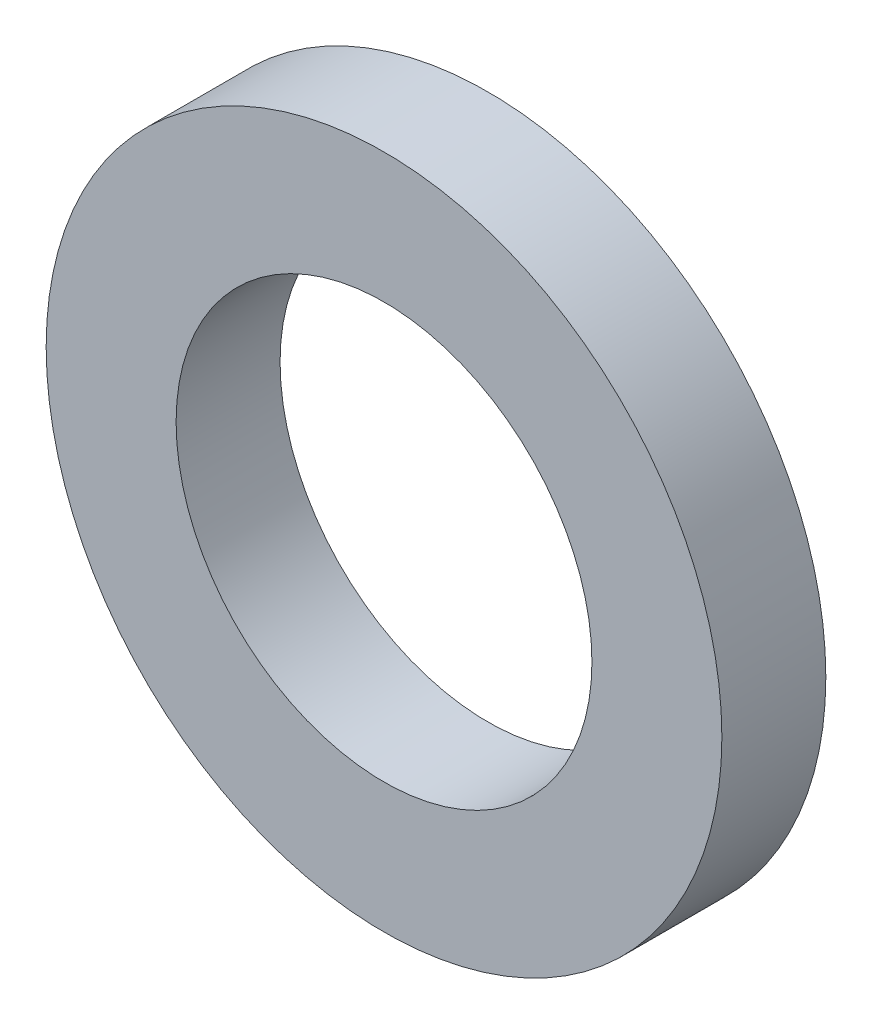
ISO-10303-21;
HEADER;
FILE_DESCRIPTION(('STEP AP214'),'2;1');
FILE_NAME('part.step','',(''),(''),'','','');
FILE_SCHEMA(('AUTOMOTIVE_DESIGN { 1 0 10303 214 1 1 1 1 }'));
ENDSEC;
DATA;
#1=APPLICATION_CONTEXT('core data for automotive mechanical design processes');
#2=APPLICATION_PROTOCOL_DEFINITION('international standard','automotive_design',2000,#1);
#3=PRODUCT_CONTEXT('',#1,'mechanical');
#4=PRODUCT('Part','Part','',(#3));
#5=PRODUCT_RELATED_PRODUCT_CATEGORY('part','',(#4));
#6=PRODUCT_DEFINITION_FORMATION('','',#4);
#7=PRODUCT_DEFINITION_CONTEXT('part definition',#1,'design');
#8=PRODUCT_DEFINITION('design','',#6,#7);
#9=PRODUCT_DEFINITION_SHAPE('','',#8);
#10=(LENGTH_UNIT() NAMED_UNIT(*) SI_UNIT(.MILLI.,.METRE.));
#11=(NAMED_UNIT(*) PLANE_ANGLE_UNIT() SI_UNIT($,.RADIAN.));
#12=(NAMED_UNIT(*) SI_UNIT($,.STERADIAN.) SOLID_ANGLE_UNIT());
#13=UNCERTAINTY_MEASURE_WITH_UNIT(LENGTH_MEASURE(1.E-05),#10,'distance_accuracy_value','');
#14=(GEOMETRIC_REPRESENTATION_CONTEXT(3) GLOBAL_UNCERTAINTY_ASSIGNED_CONTEXT((#13)) GLOBAL_UNIT_ASSIGNED_CONTEXT((#10,
#11,#12)) REPRESENTATION_CONTEXT('',''));
#15=CARTESIAN_POINT('',(0.,0.,0.));
#16=DIRECTION('',(0.,0.,1.));
#17=DIRECTION('',(1.,0.,0.));
#18=AXIS2_PLACEMENT_3D('',#15,#16,#17);
#19=CARTESIAN_POINT('',(0.,0.,2.));
#20=DIRECTION('',(0.,0.,1.));
#21=DIRECTION('',(1.,0.,0.));
#22=AXIS2_PLACEMENT_3D('',#19,#20,#21);
#23=PLANE('',#22);
#24=CARTESIAN_POINT('',(0.,0.,2.));
#25=DIRECTION('',(0.,0.,1.));
#26=DIRECTION('',(1.,0.,0.));
#27=AXIS2_PLACEMENT_3D('',#24,#25,#26);
#28=CIRCLE('',#27,6.5);
#29=CARTESIAN_POINT('',(6.5,0.,2.));
#30=VERTEX_POINT('',#29);
#31=EDGE_CURVE('E10',#30,#30,#28,.T.);
#32=ORIENTED_EDGE('',*,*,#31,.T.);
#33=EDGE_LOOP('',(#32));
#34=FACE_BOUND('',#33,.T.);
#35=CARTESIAN_POINT('',(0.,0.,2.));
#36=DIRECTION('',(0.,0.,1.));
#37=DIRECTION('',(1.,0.,0.));
#38=AXIS2_PLACEMENT_3D('',#35,#36,#37);
#39=CIRCLE('',#38,4.);
#40=CARTESIAN_POINT('',(4.,0.,2.));
#41=VERTEX_POINT('',#40);
#42=EDGE_CURVE('E41',#41,#41,#39,.T.);
#43=ORIENTED_EDGE('',*,*,#42,.F.);
#44=EDGE_LOOP('',(#43));
#45=FACE_BOUND('',#44,.T.);
#46=ADVANCED_FACE('F30',(#34,#45),#23,.T.);
#47=CARTESIAN_POINT('',(0.,0.,0.));
#48=DIRECTION('',(0.,0.,1.));
#49=DIRECTION('',(1.,0.,0.));
#50=AXIS2_PLACEMENT_3D('',#47,#48,#49);
#51=PLANE('',#50);
#52=CARTESIAN_POINT('',(0.,0.,0.));
#53=DIRECTION('',(0.,0.,1.));
#54=DIRECTION('',(1.,0.,0.));
#55=AXIS2_PLACEMENT_3D('',#52,#53,#54);
#56=CIRCLE('',#55,6.5);
#57=CARTESIAN_POINT('',(6.5,0.,0.));
#58=VERTEX_POINT('',#57);
#59=EDGE_CURVE('E34',#58,#58,#56,.T.);
#60=ORIENTED_EDGE('',*,*,#59,.F.);
#61=EDGE_LOOP('',(#60));
#62=FACE_BOUND('',#61,.T.);
#63=CARTESIAN_POINT('',(0.,0.,0.));
#64=DIRECTION('',(0.,0.,1.));
#65=DIRECTION('',(1.,0.,0.));
#66=AXIS2_PLACEMENT_3D('',#63,#64,#65);
#67=CIRCLE('',#66,4.);
#68=CARTESIAN_POINT('',(4.,0.,0.));
#69=VERTEX_POINT('',#68);
#70=EDGE_CURVE('E43',#69,#69,#67,.T.);
#71=ORIENTED_EDGE('',*,*,#70,.T.);
#72=EDGE_LOOP('',(#71));
#73=FACE_BOUND('',#72,.T.);
#74=ADVANCED_FACE('F53',(#62,#73),#51,.F.);
#75=CARTESIAN_POINT('',(0.,0.,2.));
#76=DIRECTION('',(0.,0.,-1.));
#77=DIRECTION('',(-1.,0.,0.));
#78=AXIS2_PLACEMENT_3D('',#75,#76,#77);
#79=CYLINDRICAL_SURFACE('',#78,6.5);
#80=ORIENTED_EDGE('',*,*,#31,.F.);
#81=EDGE_LOOP('',(#80));
#82=FACE_BOUND('',#81,.T.);
#83=ORIENTED_EDGE('',*,*,#59,.T.);
#84=EDGE_LOOP('',(#83));
#85=FACE_BOUND('',#84,.T.);
#86=ADVANCED_FACE('F32',(#82,#85),#79,.T.);
#87=CARTESIAN_POINT('',(0.,0.,2.));
#88=DIRECTION('',(0.,0.,-1.));
#89=DIRECTION('',(-1.,0.,0.));
#90=AXIS2_PLACEMENT_3D('',#87,#88,#89);
#91=CYLINDRICAL_SURFACE('',#90,4.);
#92=ORIENTED_EDGE('',*,*,#42,.T.);
#93=EDGE_LOOP('',(#92));
#94=FACE_BOUND('',#93,.T.);
#95=ORIENTED_EDGE('',*,*,#70,.F.);
#96=EDGE_LOOP('',(#95));
#97=FACE_BOUND('',#96,.T.);
#98=ADVANCED_FACE('F49',(#94,#97),#91,.F.);
#99=CLOSED_SHELL('',(#46,#74,#86,#98));
#100=MANIFOLD_SOLID_BREP('B2',#99);
#101=ADVANCED_BREP_SHAPE_REPRESENTATION('',(#18,#100),#14);
#102=SHAPE_DEFINITION_REPRESENTATION(#9,#101);
ENDSEC;
END-ISO-10303-21;
